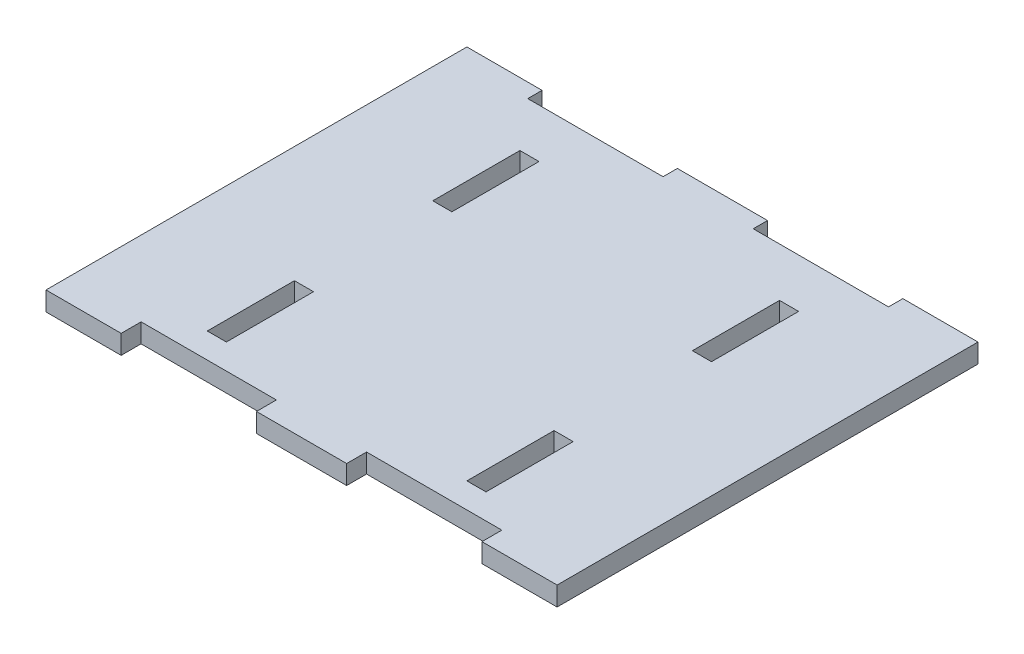
ISO-10303-21;
HEADER;
FILE_DESCRIPTION(('STEP AP214'),'2;1');
FILE_NAME('part.step','',(''),(''),'','','');
FILE_SCHEMA(('AUTOMOTIVE_DESIGN { 1 0 10303 214 1 1 1 1 }'));
ENDSEC;
DATA;
#1=APPLICATION_CONTEXT('core data for automotive mechanical design processes');
#2=APPLICATION_PROTOCOL_DEFINITION('international standard','automotive_design',2000,#1);
#3=PRODUCT_CONTEXT('',#1,'mechanical');
#4=PRODUCT('Part','Part','',(#3));
#5=PRODUCT_RELATED_PRODUCT_CATEGORY('part','',(#4));
#6=PRODUCT_DEFINITION_FORMATION('','',#4);
#7=PRODUCT_DEFINITION_CONTEXT('part definition',#1,'design');
#8=PRODUCT_DEFINITION('design','',#6,#7);
#9=PRODUCT_DEFINITION_SHAPE('','',#8);
#10=(LENGTH_UNIT() NAMED_UNIT(*) SI_UNIT(.MILLI.,.METRE.));
#11=(NAMED_UNIT(*) PLANE_ANGLE_UNIT() SI_UNIT($,.RADIAN.));
#12=(NAMED_UNIT(*) SI_UNIT($,.STERADIAN.) SOLID_ANGLE_UNIT());
#13=UNCERTAINTY_MEASURE_WITH_UNIT(LENGTH_MEASURE(1.E-05),#10,'distance_accuracy_value','');
#14=(GEOMETRIC_REPRESENTATION_CONTEXT(3) GLOBAL_UNCERTAINTY_ASSIGNED_CONTEXT((#13)) GLOBAL_UNIT_ASSIGNED_CONTEXT((#10,
#11,#12)) REPRESENTATION_CONTEXT('',''));
#15=CARTESIAN_POINT('',(0.,0.,0.));
#16=DIRECTION('',(0.,0.,1.));
#17=DIRECTION('',(1.,0.,0.));
#18=AXIS2_PLACEMENT_3D('',#15,#16,#17);
#19=CARTESIAN_POINT('',(0.,3.175,0.));
#20=DIRECTION('',(0.,0.,-1.));
#21=DIRECTION('',(-1.,0.,0.));
#22=AXIS2_PLACEMENT_3D('',#19,#20,#21);
#23=PLANE('',#22);
#24=DIRECTION('',(1.,0.,0.));
#25=VECTOR('',#24,1.);
#26=CARTESIAN_POINT('',(0.,3.175,0.));
#27=LINE('',#26,#25);
#28=CARTESIAN_POINT('',(35.,3.175,0.));
#29=VERTEX_POINT('',#28);
#30=CARTESIAN_POINT('',(50.,3.175,0.));
#31=VERTEX_POINT('',#30);
#32=EDGE_CURVE('E352',#29,#31,#27,.T.);
#33=ORIENTED_EDGE('',*,*,#32,.F.);
#34=DIRECTION('',(0.,-1.,0.));
#35=VECTOR('',#34,1.);
#36=CARTESIAN_POINT('',(35.,3.175,0.));
#37=LINE('',#36,#35);
#38=CARTESIAN_POINT('',(35.,0.,0.));
#39=VERTEX_POINT('',#38);
#40=EDGE_CURVE('E484',#29,#39,#37,.T.);
#41=ORIENTED_EDGE('',*,*,#40,.T.);
#42=DIRECTION('',(1.,0.,0.));
#43=VECTOR('',#42,1.);
#44=CARTESIAN_POINT('',(0.,0.,0.));
#45=LINE('',#44,#43);
#46=CARTESIAN_POINT('',(50.,0.,0.));
#47=VERTEX_POINT('',#46);
#48=EDGE_CURVE('E312',#39,#47,#45,.T.);
#49=ORIENTED_EDGE('',*,*,#48,.T.);
#50=DIRECTION('',(0.,-1.,0.));
#51=VECTOR('',#50,1.);
#52=CARTESIAN_POINT('',(50.,3.175,0.));
#53=LINE('',#52,#51);
#54=EDGE_CURVE('E512',#31,#47,#53,.T.);
#55=ORIENTED_EDGE('',*,*,#54,.F.);
#56=EDGE_LOOP('',(#33,#41,#49,#55));
#57=FACE_BOUND('',#56,.T.);
#58=ADVANCED_FACE('F32',(#57),#23,.F.);
#59=CARTESIAN_POINT('',(72.5,3.175,0.));
#60=VERTEX_POINT('',#59);
#61=CARTESIAN_POINT('',(85.,3.175,0.));
#62=VERTEX_POINT('',#61);
#63=EDGE_CURVE('E349',#60,#62,#27,.T.);
#64=ORIENTED_EDGE('',*,*,#63,.F.);
#65=DIRECTION('',(0.,-1.,0.));
#66=VECTOR('',#65,1.);
#67=CARTESIAN_POINT('',(72.5,3.175,0.));
#68=LINE('',#67,#66);
#69=CARTESIAN_POINT('',(72.5,0.,0.));
#70=VERTEX_POINT('',#69);
#71=EDGE_CURVE('E509',#60,#70,#68,.T.);
#72=ORIENTED_EDGE('',*,*,#71,.T.);
#73=CARTESIAN_POINT('',(85.,0.,0.));
#74=VERTEX_POINT('',#73);
#75=EDGE_CURVE('E306',#70,#74,#45,.T.);
#76=ORIENTED_EDGE('',*,*,#75,.T.);
#77=DIRECTION('',(0.,-1.,0.));
#78=VECTOR('',#77,1.);
#79=CARTESIAN_POINT('',(85.,3.175,0.));
#80=LINE('',#79,#78);
#81=EDGE_CURVE('E40',#62,#74,#80,.T.);
#82=ORIENTED_EDGE('',*,*,#81,.F.);
#83=EDGE_LOOP('',(#64,#72,#76,#82));
#84=FACE_BOUND('',#83,.T.);
#85=ADVANCED_FACE('F581',(#84),#23,.F.);
#86=CARTESIAN_POINT('',(0.,3.175,-70.));
#87=DIRECTION('',(0.,0.,1.));
#88=DIRECTION('',(1.,0.,0.));
#89=AXIS2_PLACEMENT_3D('',#86,#87,#88);
#90=PLANE('',#89);
#91=DIRECTION('',(-1.,0.,0.));
#92=VECTOR('',#91,1.);
#93=CARTESIAN_POINT('',(0.,0.,-70.));
#94=LINE('',#93,#92);
#95=CARTESIAN_POINT('',(50.,0.,-70.));
#96=VERTEX_POINT('',#95);
#97=CARTESIAN_POINT('',(35.,0.,-70.));
#98=VERTEX_POINT('',#97);
#99=EDGE_CURVE('E319',#96,#98,#94,.T.);
#100=ORIENTED_EDGE('',*,*,#99,.T.);
#101=DIRECTION('',(0.,-1.,0.));
#102=VECTOR('',#101,1.);
#103=CARTESIAN_POINT('',(35.,3.175,-70.));
#104=LINE('',#103,#102);
#105=CARTESIAN_POINT('',(35.,3.175,-70.));
#106=VERTEX_POINT('',#105);
#107=EDGE_CURVE('E293',#106,#98,#104,.T.);
#108=ORIENTED_EDGE('',*,*,#107,.F.);
#109=DIRECTION('',(-1.,0.,0.));
#110=VECTOR('',#109,1.);
#111=CARTESIAN_POINT('',(0.,3.175,-70.));
#112=LINE('',#111,#110);
#113=CARTESIAN_POINT('',(50.,3.175,-70.));
#114=VERTEX_POINT('',#113);
#115=EDGE_CURVE('E285',#114,#106,#112,.T.);
#116=ORIENTED_EDGE('',*,*,#115,.F.);
#117=DIRECTION('',(0.,-1.,0.));
#118=VECTOR('',#117,1.);
#119=CARTESIAN_POINT('',(50.,3.175,-70.));
#120=LINE('',#119,#118);
#121=EDGE_CURVE('E265',#114,#96,#120,.T.);
#122=ORIENTED_EDGE('',*,*,#121,.T.);
#123=EDGE_LOOP('',(#100,#108,#116,#122));
#124=FACE_BOUND('',#123,.T.);
#125=ADVANCED_FACE('F292',(#124),#90,.F.);
#126=CARTESIAN_POINT('',(12.5,3.175,-70.));
#127=VERTEX_POINT('',#126);
#128=CARTESIAN_POINT('',(0.,3.175,-70.));
#129=VERTEX_POINT('',#128);
#130=EDGE_CURVE('E295',#127,#129,#112,.T.);
#131=ORIENTED_EDGE('',*,*,#130,.F.);
#132=DIRECTION('',(0.,-1.,0.));
#133=VECTOR('',#132,1.);
#134=CARTESIAN_POINT('',(12.5,3.175,-70.));
#135=LINE('',#134,#133);
#136=CARTESIAN_POINT('',(12.5,0.,-70.));
#137=VERTEX_POINT('',#136);
#138=EDGE_CURVE('E540',#127,#137,#135,.T.);
#139=ORIENTED_EDGE('',*,*,#138,.T.);
#140=CARTESIAN_POINT('',(0.,0.,-70.));
#141=VERTEX_POINT('',#140);
#142=EDGE_CURVE('E314',#137,#141,#94,.T.);
#143=ORIENTED_EDGE('',*,*,#142,.T.);
#144=DIRECTION('',(0.,-1.,0.));
#145=VECTOR('',#144,1.);
#146=CARTESIAN_POINT('',(0.,3.175,-70.));
#147=LINE('',#146,#145);
#148=EDGE_CURVE('E298',#129,#141,#147,.T.);
#149=ORIENTED_EDGE('',*,*,#148,.F.);
#150=EDGE_LOOP('',(#131,#139,#143,#149));
#151=FACE_BOUND('',#150,.T.);
#152=ADVANCED_FACE('F595',(#151),#90,.F.);
#153=CARTESIAN_POINT('',(0.,3.175,0.));
#154=DIRECTION('',(1.,0.,0.));
#155=DIRECTION('',(0.,0.,-1.));
#156=AXIS2_PLACEMENT_3D('',#153,#154,#155);
#157=PLANE('',#156);
#158=DIRECTION('',(0.,0.,1.));
#159=VECTOR('',#158,1.);
#160=CARTESIAN_POINT('',(0.,0.,0.));
#161=LINE('',#160,#159);
#162=CARTESIAN_POINT('',(0.,0.,0.));
#163=VERTEX_POINT('',#162);
#164=EDGE_CURVE('E303',#141,#163,#161,.T.);
#165=ORIENTED_EDGE('',*,*,#164,.T.);
#166=DIRECTION('',(0.,-1.,0.));
#167=VECTOR('',#166,1.);
#168=CARTESIAN_POINT('',(0.,3.175,0.));
#169=LINE('',#168,#167);
#170=CARTESIAN_POINT('',(0.,3.175,0.));
#171=VERTEX_POINT('',#170);
#172=EDGE_CURVE('E11',#171,#163,#169,.T.);
#173=ORIENTED_EDGE('',*,*,#172,.F.);
#174=DIRECTION('',(0.,0.,1.));
#175=VECTOR('',#174,1.);
#176=CARTESIAN_POINT('',(0.,3.175,0.));
#177=LINE('',#176,#175);
#178=EDGE_CURVE('E318',#129,#171,#177,.T.);
#179=ORIENTED_EDGE('',*,*,#178,.F.);
#180=ORIENTED_EDGE('',*,*,#148,.T.);
#181=EDGE_LOOP('',(#165,#173,#179,#180));
#182=FACE_BOUND('',#181,.T.);
#183=ADVANCED_FACE('F34',(#182),#157,.F.);
#184=CARTESIAN_POINT('',(12.5,0.,0.));
#185=VERTEX_POINT('',#184);
#186=EDGE_CURVE('E308',#163,#185,#45,.T.);
#187=ORIENTED_EDGE('',*,*,#186,.T.);
#188=DIRECTION('',(0.,-1.,0.));
#189=VECTOR('',#188,1.);
#190=CARTESIAN_POINT('',(12.5,3.175,0.));
#191=LINE('',#190,#189);
#192=CARTESIAN_POINT('',(12.5,3.175,0.));
#193=VERTEX_POINT('',#192);
#194=EDGE_CURVE('E487',#193,#185,#191,.T.);
#195=ORIENTED_EDGE('',*,*,#194,.F.);
#196=EDGE_CURVE('E350',#171,#193,#27,.T.);
#197=ORIENTED_EDGE('',*,*,#196,.F.);
#198=ORIENTED_EDGE('',*,*,#172,.T.);
#199=EDGE_LOOP('',(#187,#195,#197,#198));
#200=FACE_BOUND('',#199,.T.);
#201=ADVANCED_FACE('F583',(#200),#23,.F.);
#202=CARTESIAN_POINT('',(85.,3.175,0.));
#203=DIRECTION('',(-1.,0.,0.));
#204=DIRECTION('',(0.,0.,1.));
#205=AXIS2_PLACEMENT_3D('',#202,#203,#204);
#206=PLANE('',#205);
#207=DIRECTION('',(0.,0.,-1.));
#208=VECTOR('',#207,1.);
#209=CARTESIAN_POINT('',(85.,0.,0.));
#210=LINE('',#209,#208);
#211=CARTESIAN_POINT('',(85.,0.,-70.));
#212=VERTEX_POINT('',#211);
#213=EDGE_CURVE('E311',#74,#212,#210,.T.);
#214=ORIENTED_EDGE('',*,*,#213,.T.);
#215=DIRECTION('',(0.,-1.,0.));
#216=VECTOR('',#215,1.);
#217=CARTESIAN_POINT('',(85.,3.175,-70.));
#218=LINE('',#217,#216);
#219=CARTESIAN_POINT('',(85.,3.175,-70.));
#220=VERTEX_POINT('',#219);
#221=EDGE_CURVE('E322',#220,#212,#218,.T.);
#222=ORIENTED_EDGE('',*,*,#221,.F.);
#223=DIRECTION('',(0.,0.,-1.));
#224=VECTOR('',#223,1.);
#225=CARTESIAN_POINT('',(85.,3.175,0.));
#226=LINE('',#225,#224);
#227=EDGE_CURVE('E299',#62,#220,#226,.T.);
#228=ORIENTED_EDGE('',*,*,#227,.F.);
#229=ORIENTED_EDGE('',*,*,#81,.T.);
#230=EDGE_LOOP('',(#214,#222,#228,#229));
#231=FACE_BOUND('',#230,.T.);
#232=ADVANCED_FACE('F329',(#231),#206,.F.);
#233=CARTESIAN_POINT('',(72.5,0.,-70.));
#234=VERTEX_POINT('',#233);
#235=EDGE_CURVE('E315',#212,#234,#94,.T.);
#236=ORIENTED_EDGE('',*,*,#235,.T.);
#237=DIRECTION('',(0.,-1.,0.));
#238=VECTOR('',#237,1.);
#239=CARTESIAN_POINT('',(72.5,3.175,-70.));
#240=LINE('',#239,#238);
#241=CARTESIAN_POINT('',(72.5,3.175,-70.));
#242=VERTEX_POINT('',#241);
#243=EDGE_CURVE('E276',#242,#234,#240,.T.);
#244=ORIENTED_EDGE('',*,*,#243,.F.);
#245=EDGE_CURVE('E294',#220,#242,#112,.T.);
#246=ORIENTED_EDGE('',*,*,#245,.F.);
#247=ORIENTED_EDGE('',*,*,#221,.T.);
#248=EDGE_LOOP('',(#236,#244,#246,#247));
#249=FACE_BOUND('',#248,.T.);
#250=ADVANCED_FACE('F346',(#249),#90,.F.);
#251=CARTESIAN_POINT('',(0.,3.175,0.));
#252=DIRECTION('',(0.,-1.,0.));
#253=DIRECTION('',(0.,0.,-1.));
#254=AXIS2_PLACEMENT_3D('',#251,#252,#253);
#255=PLANE('',#254);
#256=DIRECTION('',(1.,0.,0.));
#257=VECTOR('',#256,1.);
#258=CARTESIAN_POINT('',(35.,3.175,-3.31304347826087));
#259=LINE('',#258,#257);
#260=CARTESIAN_POINT('',(12.5,3.175,-3.31304347826088));
#261=VERTEX_POINT('',#260);
#262=CARTESIAN_POINT('',(35.,3.175,-3.31304347826087));
#263=VERTEX_POINT('',#262);
#264=EDGE_CURVE('E488',#261,#263,#259,.T.);
#265=ORIENTED_EDGE('',*,*,#264,.T.);
#266=DIRECTION('',(0.,0.,1.));
#267=VECTOR('',#266,1.);
#268=CARTESIAN_POINT('',(35.,3.175,-3.31304347826087));
#269=LINE('',#268,#267);
#270=EDGE_CURVE('E498',#263,#29,#269,.T.);
#271=ORIENTED_EDGE('',*,*,#270,.T.);
#272=ORIENTED_EDGE('',*,*,#32,.T.);
#273=DIRECTION('',(0.,0.,-1.));
#274=VECTOR('',#273,1.);
#275=CARTESIAN_POINT('',(50.,3.175,-3.31304347826087));
#276=LINE('',#275,#274);
#277=CARTESIAN_POINT('',(50.,3.175,-3.31304347826087));
#278=VERTEX_POINT('',#277);
#279=EDGE_CURVE('E530',#31,#278,#276,.T.);
#280=ORIENTED_EDGE('',*,*,#279,.T.);
#281=DIRECTION('',(1.,0.,0.));
#282=VECTOR('',#281,1.);
#283=CARTESIAN_POINT('',(72.5,3.175,-3.31304347826087));
#284=LINE('',#283,#282);
#285=CARTESIAN_POINT('',(72.5,3.175,-3.31304347826087));
#286=VERTEX_POINT('',#285);
#287=EDGE_CURVE('E513',#278,#286,#284,.T.);
#288=ORIENTED_EDGE('',*,*,#287,.T.);
#289=DIRECTION('',(0.,0.,1.));
#290=VECTOR('',#289,1.);
#291=CARTESIAN_POINT('',(72.5,3.175,-3.31304347826087));
#292=LINE('',#291,#290);
#293=EDGE_CURVE('E523',#286,#60,#292,.T.);
#294=ORIENTED_EDGE('',*,*,#293,.T.);
#295=ORIENTED_EDGE('',*,*,#63,.T.);
#296=ORIENTED_EDGE('',*,*,#227,.T.);
#297=ORIENTED_EDGE('',*,*,#245,.T.);
#298=DIRECTION('',(0.,0.,1.));
#299=VECTOR('',#298,1.);
#300=CARTESIAN_POINT('',(72.5,3.175,-70.));
#301=LINE('',#300,#299);
#302=CARTESIAN_POINT('',(72.5,3.175,-67.61875));
#303=VERTEX_POINT('',#302);
#304=EDGE_CURVE('E288',#242,#303,#301,.T.);
#305=ORIENTED_EDGE('',*,*,#304,.T.);
#306=DIRECTION('',(-1.,0.,0.));
#307=VECTOR('',#306,1.);
#308=CARTESIAN_POINT('',(50.,3.175,-67.61875));
#309=LINE('',#308,#307);
#310=CARTESIAN_POINT('',(50.,3.175,-67.61875));
#311=VERTEX_POINT('',#310);
#312=EDGE_CURVE('E277',#303,#311,#309,.T.);
#313=ORIENTED_EDGE('',*,*,#312,.T.);
#314=DIRECTION('',(0.,0.,-1.));
#315=VECTOR('',#314,1.);
#316=CARTESIAN_POINT('',(50.,3.175,-70.));
#317=LINE('',#316,#315);
#318=EDGE_CURVE('E268',#311,#114,#317,.T.);
#319=ORIENTED_EDGE('',*,*,#318,.T.);
#320=ORIENTED_EDGE('',*,*,#115,.T.);
#321=DIRECTION('',(0.,0.,1.));
#322=VECTOR('',#321,1.);
#323=CARTESIAN_POINT('',(35.,3.175,-70.));
#324=LINE('',#323,#322);
#325=CARTESIAN_POINT('',(35.,3.175,-67.61875));
#326=VERTEX_POINT('',#325);
#327=EDGE_CURVE('E546',#106,#326,#324,.T.);
#328=ORIENTED_EDGE('',*,*,#327,.T.);
#329=DIRECTION('',(-1.,0.,0.));
#330=VECTOR('',#329,1.);
#331=CARTESIAN_POINT('',(35.,3.175,-67.61875));
#332=LINE('',#331,#330);
#333=CARTESIAN_POINT('',(12.5,3.175,-67.61875));
#334=VERTEX_POINT('',#333);
#335=EDGE_CURVE('E553',#326,#334,#332,.T.);
#336=ORIENTED_EDGE('',*,*,#335,.T.);
#337=DIRECTION('',(0.,0.,-1.));
#338=VECTOR('',#337,1.);
#339=CARTESIAN_POINT('',(12.5,3.175,-70.));
#340=LINE('',#339,#338);
#341=EDGE_CURVE('E538',#334,#127,#340,.T.);
#342=ORIENTED_EDGE('',*,*,#341,.T.);
#343=ORIENTED_EDGE('',*,*,#130,.T.);
#344=ORIENTED_EDGE('',*,*,#178,.T.);
#345=ORIENTED_EDGE('',*,*,#196,.T.);
#346=DIRECTION('',(0.,0.,-1.));
#347=VECTOR('',#346,1.);
#348=CARTESIAN_POINT('',(12.5,3.175,-3.31304347826088));
#349=LINE('',#348,#347);
#350=EDGE_CURVE('E505',#193,#261,#349,.T.);
#351=ORIENTED_EDGE('',*,*,#350,.T.);
#352=EDGE_LOOP('',(#265,#271,#272,#280,#288,#294,#295,#296,#297,#305,#313,#319,#320,#328,#336,
#342,#343,#344,#345,#351));
#353=FACE_BOUND('',#352,.T.);
#354=DIRECTION('',(-1.,0.,0.));
#355=VECTOR('',#354,1.);
#356=CARTESIAN_POINT('',(62.5000000000004,3.175,-45.));
#357=LINE('',#356,#355);
#358=CARTESIAN_POINT('',(65.6750000000003,3.175,-45.));
#359=VERTEX_POINT('',#358);
#360=CARTESIAN_POINT('',(62.5000000000004,3.175,-45.));
#361=VERTEX_POINT('',#360);
#362=EDGE_CURVE('E396',#359,#361,#357,.T.);
#363=ORIENTED_EDGE('',*,*,#362,.T.);
#364=DIRECTION('',(0.,0.,-1.));
#365=VECTOR('',#364,1.);
#366=CARTESIAN_POINT('',(62.5000000000004,3.175,-45.));
#367=LINE('',#366,#365);
#368=CARTESIAN_POINT('',(62.5000000000004,3.175,-59.492));
#369=VERTEX_POINT('',#368);
#370=EDGE_CURVE('E406',#361,#369,#367,.T.);
#371=ORIENTED_EDGE('',*,*,#370,.T.);
#372=DIRECTION('',(1.,0.,0.));
#373=VECTOR('',#372,1.);
#374=CARTESIAN_POINT('',(62.5000000000004,3.175,-59.492));
#375=LINE('',#374,#373);
#376=CARTESIAN_POINT('',(65.6750000000003,3.175,-59.492));
#377=VERTEX_POINT('',#376);
#378=EDGE_CURVE('E419',#369,#377,#375,.T.);
#379=ORIENTED_EDGE('',*,*,#378,.T.);
#380=DIRECTION('',(0.,0.,1.));
#381=VECTOR('',#380,1.);
#382=CARTESIAN_POINT('',(65.6750000000003,3.175,-45.));
#383=LINE('',#382,#381);
#384=EDGE_CURVE('E47',#377,#359,#383,.T.);
#385=ORIENTED_EDGE('',*,*,#384,.T.);
#386=EDGE_LOOP('',(#363,#371,#379,#385));
#387=FACE_BOUND('',#386,.T.);
#388=DIRECTION('',(-1.,0.,0.));
#389=VECTOR('',#388,1.);
#390=CARTESIAN_POINT('',(62.5000000000006,3.175,-7.5));
#391=LINE('',#390,#389);
#392=CARTESIAN_POINT('',(65.6750000000005,3.175,-7.5));
#393=VERTEX_POINT('',#392);
#394=CARTESIAN_POINT('',(62.5000000000006,3.175,-7.5));
#395=VERTEX_POINT('',#394);
#396=EDGE_CURVE('E428',#393,#395,#391,.T.);
#397=ORIENTED_EDGE('',*,*,#396,.T.);
#398=DIRECTION('',(0.,0.,-1.));
#399=VECTOR('',#398,1.);
#400=CARTESIAN_POINT('',(62.5000000000006,3.175,-7.5));
#401=LINE('',#400,#399);
#402=CARTESIAN_POINT('',(62.5000000000006,3.175,-21.992));
#403=VERTEX_POINT('',#402);
#404=EDGE_CURVE('E438',#395,#403,#401,.T.);
#405=ORIENTED_EDGE('',*,*,#404,.T.);
#406=DIRECTION('',(1.,0.,0.));
#407=VECTOR('',#406,1.);
#408=CARTESIAN_POINT('',(62.5000000000006,3.175,-21.992));
#409=LINE('',#408,#407);
#410=CARTESIAN_POINT('',(65.6750000000005,3.175,-21.992));
#411=VERTEX_POINT('',#410);
#412=EDGE_CURVE('E449',#403,#411,#409,.T.);
#413=ORIENTED_EDGE('',*,*,#412,.T.);
#414=DIRECTION('',(0.,0.,1.));
#415=VECTOR('',#414,1.);
#416=CARTESIAN_POINT('',(65.6750000000005,3.175,-7.5));
#417=LINE('',#416,#415);
#418=EDGE_CURVE('E55',#411,#393,#417,.T.);
#419=ORIENTED_EDGE('',*,*,#418,.T.);
#420=EDGE_LOOP('',(#397,#405,#413,#419));
#421=FACE_BOUND('',#420,.T.);
#422=DIRECTION('',(-1.,0.,0.));
#423=VECTOR('',#422,1.);
#424=CARTESIAN_POINT('',(19.3250000000004,3.175,-45.));
#425=LINE('',#424,#423);
#426=CARTESIAN_POINT('',(22.5000000000003,3.175,-45.));
#427=VERTEX_POINT('',#426);
#428=CARTESIAN_POINT('',(19.3250000000004,3.175,-45.));
#429=VERTEX_POINT('',#428);
#430=EDGE_CURVE('E458',#427,#429,#425,.T.);
#431=ORIENTED_EDGE('',*,*,#430,.T.);
#432=DIRECTION('',(0.,0.,-1.));
#433=VECTOR('',#432,1.);
#434=CARTESIAN_POINT('',(19.3250000000004,3.175,-45.));
#435=LINE('',#434,#433);
#436=CARTESIAN_POINT('',(19.3250000000004,3.175,-59.492));
#437=VERTEX_POINT('',#436);
#438=EDGE_CURVE('E466',#429,#437,#435,.T.);
#439=ORIENTED_EDGE('',*,*,#438,.T.);
#440=DIRECTION('',(1.,0.,0.));
#441=VECTOR('',#440,1.);
#442=CARTESIAN_POINT('',(19.3250000000004,3.175,-59.492));
#443=LINE('',#442,#441);
#444=CARTESIAN_POINT('',(22.5000000000003,3.175,-59.492));
#445=VERTEX_POINT('',#444);
#446=EDGE_CURVE('E479',#437,#445,#443,.T.);
#447=ORIENTED_EDGE('',*,*,#446,.T.);
#448=DIRECTION('',(0.,0.,1.));
#449=VECTOR('',#448,1.);
#450=CARTESIAN_POINT('',(22.5000000000003,3.175,-45.));
#451=LINE('',#450,#449);
#452=EDGE_CURVE('E476',#445,#427,#451,.T.);
#453=ORIENTED_EDGE('',*,*,#452,.T.);
#454=EDGE_LOOP('',(#431,#439,#447,#453));
#455=FACE_BOUND('',#454,.T.);
#456=DIRECTION('',(-1.,0.,0.));
#457=VECTOR('',#456,1.);
#458=CARTESIAN_POINT('',(19.3250000000006,3.175,-7.5));
#459=LINE('',#458,#457);
#460=CARTESIAN_POINT('',(22.5000000000005,3.175,-7.5));
#461=VERTEX_POINT('',#460);
#462=CARTESIAN_POINT('',(19.3250000000006,3.175,-7.5));
#463=VERTEX_POINT('',#462);
#464=EDGE_CURVE('E364',#461,#463,#459,.T.);
#465=ORIENTED_EDGE('',*,*,#464,.T.);
#466=DIRECTION('',(0.,0.,-1.));
#467=VECTOR('',#466,1.);
#468=CARTESIAN_POINT('',(19.3250000000006,3.175,-7.5));
#469=LINE('',#468,#467);
#470=CARTESIAN_POINT('',(19.3250000000006,3.175,-21.992));
#471=VERTEX_POINT('',#470);
#472=EDGE_CURVE('E372',#463,#471,#469,.T.);
#473=ORIENTED_EDGE('',*,*,#472,.T.);
#474=DIRECTION('',(1.,0.,0.));
#475=VECTOR('',#474,1.);
#476=CARTESIAN_POINT('',(19.3250000000006,3.175,-21.992));
#477=LINE('',#476,#475);
#478=CARTESIAN_POINT('',(22.5000000000005,3.175,-21.992));
#479=VERTEX_POINT('',#478);
#480=EDGE_CURVE('E387',#471,#479,#477,.T.);
#481=ORIENTED_EDGE('',*,*,#480,.T.);
#482=DIRECTION('',(0.,0.,1.));
#483=VECTOR('',#482,1.);
#484=CARTESIAN_POINT('',(22.5000000000005,3.175,-7.5));
#485=LINE('',#484,#483);
#486=EDGE_CURVE('E384',#479,#461,#485,.T.);
#487=ORIENTED_EDGE('',*,*,#486,.T.);
#488=EDGE_LOOP('',(#465,#473,#481,#487));
#489=FACE_BOUND('',#488,.T.);
#490=ADVANCED_FACE('F282',(#353,#387,#421,#455,#489),#255,.F.);
#491=CARTESIAN_POINT('',(0.,0.,0.));
#492=DIRECTION('',(0.,-1.,0.));
#493=DIRECTION('',(0.,0.,-1.));
#494=AXIS2_PLACEMENT_3D('',#491,#492,#493);
#495=PLANE('',#494);
#496=DIRECTION('',(0.,0.,1.));
#497=VECTOR('',#496,1.);
#498=CARTESIAN_POINT('',(35.,0.,-3.31304347826087));
#499=LINE('',#498,#497);
#500=CARTESIAN_POINT('',(35.,0.,-3.31304347826087));
#501=VERTEX_POINT('',#500);
#502=EDGE_CURVE('E502',#501,#39,#499,.T.);
#503=ORIENTED_EDGE('',*,*,#502,.F.);
#504=DIRECTION('',(1.,0.,0.));
#505=VECTOR('',#504,1.);
#506=CARTESIAN_POINT('',(35.,0.,-3.31304347826087));
#507=LINE('',#506,#505);
#508=CARTESIAN_POINT('',(12.5,0.,-3.31304347826088));
#509=VERTEX_POINT('',#508);
#510=EDGE_CURVE('E495',#509,#501,#507,.T.);
#511=ORIENTED_EDGE('',*,*,#510,.F.);
#512=DIRECTION('',(0.,0.,-1.));
#513=VECTOR('',#512,1.);
#514=CARTESIAN_POINT('',(12.5,0.,-3.31304347826088));
#515=LINE('',#514,#513);
#516=EDGE_CURVE('E499',#185,#509,#515,.T.);
#517=ORIENTED_EDGE('',*,*,#516,.F.);
#518=ORIENTED_EDGE('',*,*,#186,.F.);
#519=ORIENTED_EDGE('',*,*,#164,.F.);
#520=ORIENTED_EDGE('',*,*,#142,.F.);
#521=DIRECTION('',(0.,0.,-1.));
#522=VECTOR('',#521,1.);
#523=CARTESIAN_POINT('',(12.5,0.,-70.));
#524=LINE('',#523,#522);
#525=CARTESIAN_POINT('',(12.5,0.,-67.61875));
#526=VERTEX_POINT('',#525);
#527=EDGE_CURVE('E544',#526,#137,#524,.T.);
#528=ORIENTED_EDGE('',*,*,#527,.F.);
#529=DIRECTION('',(-1.,0.,0.));
#530=VECTOR('',#529,1.);
#531=CARTESIAN_POINT('',(35.,0.,-67.61875));
#532=LINE('',#531,#530);
#533=CARTESIAN_POINT('',(35.,0.,-67.61875));
#534=VERTEX_POINT('',#533);
#535=EDGE_CURVE('E547',#534,#526,#532,.T.);
#536=ORIENTED_EDGE('',*,*,#535,.F.);
#537=DIRECTION('',(0.,0.,1.));
#538=VECTOR('',#537,1.);
#539=CARTESIAN_POINT('',(35.,0.,-70.));
#540=LINE('',#539,#538);
#541=EDGE_CURVE('E519',#98,#534,#540,.T.);
#542=ORIENTED_EDGE('',*,*,#541,.F.);
#543=ORIENTED_EDGE('',*,*,#99,.F.);
#544=DIRECTION('',(0.,0.,-1.));
#545=VECTOR('',#544,1.);
#546=CARTESIAN_POINT('',(50.,0.,-70.));
#547=LINE('',#546,#545);
#548=CARTESIAN_POINT('',(50.,0.,-67.61875));
#549=VERTEX_POINT('',#548);
#550=EDGE_CURVE('E271',#549,#96,#547,.T.);
#551=ORIENTED_EDGE('',*,*,#550,.F.);
#552=DIRECTION('',(-1.,0.,0.));
#553=VECTOR('',#552,1.);
#554=CARTESIAN_POINT('',(50.,0.,-67.61875));
#555=LINE('',#554,#553);
#556=CARTESIAN_POINT('',(72.5,0.,-67.61875));
#557=VERTEX_POINT('',#556);
#558=EDGE_CURVE('E289',#557,#549,#555,.T.);
#559=ORIENTED_EDGE('',*,*,#558,.F.);
#560=DIRECTION('',(0.,0.,1.));
#561=VECTOR('',#560,1.);
#562=CARTESIAN_POINT('',(72.5,0.,-70.));
#563=LINE('',#562,#561);
#564=EDGE_CURVE('E343',#234,#557,#563,.T.);
#565=ORIENTED_EDGE('',*,*,#564,.F.);
#566=ORIENTED_EDGE('',*,*,#235,.F.);
#567=ORIENTED_EDGE('',*,*,#213,.F.);
#568=ORIENTED_EDGE('',*,*,#75,.F.);
#569=DIRECTION('',(0.,0.,1.));
#570=VECTOR('',#569,1.);
#571=CARTESIAN_POINT('',(72.5,0.,-3.31304347826087));
#572=LINE('',#571,#570);
#573=CARTESIAN_POINT('',(72.5,0.,-3.31304347826087));
#574=VERTEX_POINT('',#573);
#575=EDGE_CURVE('E494',#574,#70,#572,.T.);
#576=ORIENTED_EDGE('',*,*,#575,.F.);
#577=DIRECTION('',(1.,0.,0.));
#578=VECTOR('',#577,1.);
#579=CARTESIAN_POINT('',(72.5,0.,-3.31304347826087));
#580=LINE('',#579,#578);
#581=CARTESIAN_POINT('',(50.,0.,-3.31304347826087));
#582=VERTEX_POINT('',#581);
#583=EDGE_CURVE('E520',#582,#574,#580,.T.);
#584=ORIENTED_EDGE('',*,*,#583,.F.);
#585=DIRECTION('',(0.,0.,-1.));
#586=VECTOR('',#585,1.);
#587=CARTESIAN_POINT('',(50.,0.,-3.31304347826087));
#588=LINE('',#587,#586);
#589=EDGE_CURVE('E524',#47,#582,#588,.T.);
#590=ORIENTED_EDGE('',*,*,#589,.F.);
#591=ORIENTED_EDGE('',*,*,#48,.F.);
#592=EDGE_LOOP('',(#503,#511,#517,#518,#519,#520,#528,#536,#542,#543,#551,#559,#565,#566,#567,
#568,#576,#584,#590,#591));
#593=FACE_BOUND('',#592,.T.);
#594=DIRECTION('',(0.,0.,-1.));
#595=VECTOR('',#594,1.);
#596=CARTESIAN_POINT('',(62.5000000000004,0.,-45.));
#597=LINE('',#596,#595);
#598=CARTESIAN_POINT('',(62.5000000000004,0.,-45.));
#599=VERTEX_POINT('',#598);
#600=CARTESIAN_POINT('',(62.5000000000004,0.,-59.492));
#601=VERTEX_POINT('',#600);
#602=EDGE_CURVE('E413',#599,#601,#597,.T.);
#603=ORIENTED_EDGE('',*,*,#602,.F.);
#604=DIRECTION('',(-1.,0.,0.));
#605=VECTOR('',#604,1.);
#606=CARTESIAN_POINT('',(62.5000000000004,0.,-45.));
#607=LINE('',#606,#605);
#608=CARTESIAN_POINT('',(65.6750000000003,0.,-45.));
#609=VERTEX_POINT('',#608);
#610=EDGE_CURVE('E403',#609,#599,#607,.T.);
#611=ORIENTED_EDGE('',*,*,#610,.F.);
#612=DIRECTION('',(0.,0.,1.));
#613=VECTOR('',#612,1.);
#614=CARTESIAN_POINT('',(65.6750000000003,0.,-45.));
#615=LINE('',#614,#613);
#616=CARTESIAN_POINT('',(65.6750000000003,0.,-59.492));
#617=VERTEX_POINT('',#616);
#618=EDGE_CURVE('E407',#617,#609,#615,.T.);
#619=ORIENTED_EDGE('',*,*,#618,.F.);
#620=DIRECTION('',(1.,0.,0.));
#621=VECTOR('',#620,1.);
#622=CARTESIAN_POINT('',(62.5000000000004,0.,-59.492));
#623=LINE('',#622,#621);
#624=EDGE_CURVE('E410',#601,#617,#623,.T.);
#625=ORIENTED_EDGE('',*,*,#624,.F.);
#626=EDGE_LOOP('',(#603,#611,#619,#625));
#627=FACE_BOUND('',#626,.T.);
#628=DIRECTION('',(0.,0.,-1.));
#629=VECTOR('',#628,1.);
#630=CARTESIAN_POINT('',(62.5000000000006,0.,-7.5));
#631=LINE('',#630,#629);
#632=CARTESIAN_POINT('',(62.5000000000006,0.,-7.5));
#633=VERTEX_POINT('',#632);
#634=CARTESIAN_POINT('',(62.5000000000006,0.,-21.992));
#635=VERTEX_POINT('',#634);
#636=EDGE_CURVE('E402',#633,#635,#631,.T.);
#637=ORIENTED_EDGE('',*,*,#636,.F.);
#638=DIRECTION('',(-1.,0.,0.));
#639=VECTOR('',#638,1.);
#640=CARTESIAN_POINT('',(62.5000000000006,0.,-7.5));
#641=LINE('',#640,#639);
#642=CARTESIAN_POINT('',(65.6750000000005,0.,-7.5));
#643=VERTEX_POINT('',#642);
#644=EDGE_CURVE('E435',#643,#633,#641,.T.);
#645=ORIENTED_EDGE('',*,*,#644,.F.);
#646=DIRECTION('',(0.,0.,1.));
#647=VECTOR('',#646,1.);
#648=CARTESIAN_POINT('',(65.6750000000005,0.,-7.5));
#649=LINE('',#648,#647);
#650=CARTESIAN_POINT('',(65.6750000000005,0.,-21.992));
#651=VERTEX_POINT('',#650);
#652=EDGE_CURVE('E439',#651,#643,#649,.T.);
#653=ORIENTED_EDGE('',*,*,#652,.F.);
#654=DIRECTION('',(1.,0.,0.));
#655=VECTOR('',#654,1.);
#656=CARTESIAN_POINT('',(62.5000000000006,0.,-21.992));
#657=LINE('',#656,#655);
#658=EDGE_CURVE('E442',#635,#651,#657,.T.);
#659=ORIENTED_EDGE('',*,*,#658,.F.);
#660=EDGE_LOOP('',(#637,#645,#653,#659));
#661=FACE_BOUND('',#660,.T.);
#662=DIRECTION('',(0.,0.,-1.));
#663=VECTOR('',#662,1.);
#664=CARTESIAN_POINT('',(19.3250000000004,0.,-45.));
#665=LINE('',#664,#663);
#666=CARTESIAN_POINT('',(19.3250000000004,0.,-45.));
#667=VERTEX_POINT('',#666);
#668=CARTESIAN_POINT('',(19.3250000000004,0.,-59.492));
#669=VERTEX_POINT('',#668);
#670=EDGE_CURVE('E434',#667,#669,#665,.T.);
#671=ORIENTED_EDGE('',*,*,#670,.F.);
#672=DIRECTION('',(-1.,0.,0.));
#673=VECTOR('',#672,1.);
#674=CARTESIAN_POINT('',(19.3250000000004,0.,-45.));
#675=LINE('',#674,#673);
#676=CARTESIAN_POINT('',(22.5000000000003,0.,-45.));
#677=VERTEX_POINT('',#676);
#678=EDGE_CURVE('E463',#677,#667,#675,.T.);
#679=ORIENTED_EDGE('',*,*,#678,.F.);
#680=DIRECTION('',(0.,0.,1.));
#681=VECTOR('',#680,1.);
#682=CARTESIAN_POINT('',(22.5000000000003,0.,-45.));
#683=LINE('',#682,#681);
#684=CARTESIAN_POINT('',(22.5000000000003,0.,-59.492));
#685=VERTEX_POINT('',#684);
#686=EDGE_CURVE('E467',#685,#677,#683,.T.);
#687=ORIENTED_EDGE('',*,*,#686,.F.);
#688=DIRECTION('',(1.,0.,0.));
#689=VECTOR('',#688,1.);
#690=CARTESIAN_POINT('',(19.3250000000004,0.,-59.492));
#691=LINE('',#690,#689);
#692=EDGE_CURVE('E470',#669,#685,#691,.T.);
#693=ORIENTED_EDGE('',*,*,#692,.F.);
#694=EDGE_LOOP('',(#671,#679,#687,#693));
#695=FACE_BOUND('',#694,.T.);
#696=DIRECTION('',(0.,0.,-1.));
#697=VECTOR('',#696,1.);
#698=CARTESIAN_POINT('',(19.3250000000006,0.,-7.5));
#699=LINE('',#698,#697);
#700=CARTESIAN_POINT('',(19.3250000000006,0.,-7.5));
#701=VERTEX_POINT('',#700);
#702=CARTESIAN_POINT('',(19.3250000000006,0.,-21.992));
#703=VERTEX_POINT('',#702);
#704=EDGE_CURVE('E379',#701,#703,#699,.T.);
#705=ORIENTED_EDGE('',*,*,#704,.F.);
#706=DIRECTION('',(-1.,0.,0.));
#707=VECTOR('',#706,1.);
#708=CARTESIAN_POINT('',(19.3250000000006,0.,-7.5));
#709=LINE('',#708,#707);
#710=CARTESIAN_POINT('',(22.5000000000005,0.,-7.5));
#711=VERTEX_POINT('',#710);
#712=EDGE_CURVE('E369',#711,#701,#709,.T.);
#713=ORIENTED_EDGE('',*,*,#712,.F.);
#714=DIRECTION('',(0.,0.,1.));
#715=VECTOR('',#714,1.);
#716=CARTESIAN_POINT('',(22.5000000000005,0.,-7.5));
#717=LINE('',#716,#715);
#718=CARTESIAN_POINT('',(22.5000000000005,0.,-21.992));
#719=VERTEX_POINT('',#718);
#720=EDGE_CURVE('E373',#719,#711,#717,.T.);
#721=ORIENTED_EDGE('',*,*,#720,.F.);
#722=DIRECTION('',(1.,0.,0.));
#723=VECTOR('',#722,1.);
#724=CARTESIAN_POINT('',(19.3250000000006,0.,-21.992));
#725=LINE('',#724,#723);
#726=EDGE_CURVE('E376',#703,#719,#725,.T.);
#727=ORIENTED_EDGE('',*,*,#726,.F.);
#728=EDGE_LOOP('',(#705,#713,#721,#727));
#729=FACE_BOUND('',#728,.T.);
#730=ADVANCED_FACE('F337',(#593,#627,#661,#695,#729),#495,.T.);
#731=CARTESIAN_POINT('',(19.3250000000006,3.175,-7.5));
#732=DIRECTION('',(-1.,0.,0.));
#733=DIRECTION('',(0.,0.,1.));
#734=AXIS2_PLACEMENT_3D('',#731,#732,#733);
#735=PLANE('',#734);
#736=ORIENTED_EDGE('',*,*,#704,.T.);
#737=DIRECTION('',(0.,-1.,0.));
#738=VECTOR('',#737,1.);
#739=CARTESIAN_POINT('',(19.3250000000006,3.175,-21.992));
#740=LINE('',#739,#738);
#741=EDGE_CURVE('E360',#471,#703,#740,.T.);
#742=ORIENTED_EDGE('',*,*,#741,.F.);
#743=ORIENTED_EDGE('',*,*,#472,.F.);
#744=DIRECTION('',(0.,-1.,0.));
#745=VECTOR('',#744,1.);
#746=CARTESIAN_POINT('',(19.3250000000006,3.175,-7.5));
#747=LINE('',#746,#745);
#748=EDGE_CURVE('E307',#463,#701,#747,.T.);
#749=ORIENTED_EDGE('',*,*,#748,.T.);
#750=EDGE_LOOP('',(#736,#742,#743,#749));
#751=FACE_BOUND('',#750,.T.);
#752=ADVANCED_FACE('F690',(#751),#735,.F.);
#753=CARTESIAN_POINT('',(19.3250000000006,3.175,-7.5));
#754=DIRECTION('',(0.,0.,1.));
#755=DIRECTION('',(1.,0.,0.));
#756=AXIS2_PLACEMENT_3D('',#753,#754,#755);
#757=PLANE('',#756);
#758=ORIENTED_EDGE('',*,*,#712,.T.);
#759=ORIENTED_EDGE('',*,*,#748,.F.);
#760=ORIENTED_EDGE('',*,*,#464,.F.);
#761=DIRECTION('',(0.,-1.,0.));
#762=VECTOR('',#761,1.);
#763=CARTESIAN_POINT('',(22.5000000000005,3.175,-7.5));
#764=LINE('',#763,#762);
#765=EDGE_CURVE('E366',#461,#711,#764,.T.);
#766=ORIENTED_EDGE('',*,*,#765,.T.);
#767=EDGE_LOOP('',(#758,#759,#760,#766));
#768=FACE_BOUND('',#767,.T.);
#769=ADVANCED_FACE('F686',(#768),#757,.F.);
#770=CARTESIAN_POINT('',(22.5000000000005,3.175,-7.5));
#771=DIRECTION('',(1.,0.,0.));
#772=DIRECTION('',(0.,0.,-1.));
#773=AXIS2_PLACEMENT_3D('',#770,#771,#772);
#774=PLANE('',#773);
#775=ORIENTED_EDGE('',*,*,#720,.T.);
#776=ORIENTED_EDGE('',*,*,#765,.F.);
#777=ORIENTED_EDGE('',*,*,#486,.F.);
#778=DIRECTION('',(0.,-1.,0.));
#779=VECTOR('',#778,1.);
#780=CARTESIAN_POINT('',(22.5000000000005,3.175,-21.992));
#781=LINE('',#780,#779);
#782=EDGE_CURVE('E363',#479,#719,#781,.T.);
#783=ORIENTED_EDGE('',*,*,#782,.T.);
#784=EDGE_LOOP('',(#775,#776,#777,#783));
#785=FACE_BOUND('',#784,.T.);
#786=ADVANCED_FACE('F689',(#785),#774,.F.);
#787=CARTESIAN_POINT('',(19.3250000000006,3.175,-21.992));
#788=DIRECTION('',(0.,0.,-1.));
#789=DIRECTION('',(-1.,0.,0.));
#790=AXIS2_PLACEMENT_3D('',#787,#788,#789);
#791=PLANE('',#790);
#792=ORIENTED_EDGE('',*,*,#726,.T.);
#793=ORIENTED_EDGE('',*,*,#782,.F.);
#794=ORIENTED_EDGE('',*,*,#480,.F.);
#795=ORIENTED_EDGE('',*,*,#741,.T.);
#796=EDGE_LOOP('',(#792,#793,#794,#795));
#797=FACE_BOUND('',#796,.T.);
#798=ADVANCED_FACE('F656',(#797),#791,.F.);
#799=CARTESIAN_POINT('',(19.3250000000004,3.175,-45.));
#800=DIRECTION('',(-1.,0.,0.));
#801=DIRECTION('',(0.,0.,1.));
#802=AXIS2_PLACEMENT_3D('',#799,#800,#801);
#803=PLANE('',#802);
#804=ORIENTED_EDGE('',*,*,#670,.T.);
#805=DIRECTION('',(0.,-1.,0.));
#806=VECTOR('',#805,1.);
#807=CARTESIAN_POINT('',(19.3250000000004,3.175,-59.492));
#808=LINE('',#807,#806);
#809=EDGE_CURVE('E454',#437,#669,#808,.T.);
#810=ORIENTED_EDGE('',*,*,#809,.F.);
#811=ORIENTED_EDGE('',*,*,#438,.F.);
#812=DIRECTION('',(0.,-1.,0.));
#813=VECTOR('',#812,1.);
#814=CARTESIAN_POINT('',(19.3250000000004,3.175,-45.));
#815=LINE('',#814,#813);
#816=EDGE_CURVE('E381',#429,#667,#815,.T.);
#817=ORIENTED_EDGE('',*,*,#816,.T.);
#818=EDGE_LOOP('',(#804,#810,#811,#817));
#819=FACE_BOUND('',#818,.T.);
#820=ADVANCED_FACE('F644',(#819),#803,.F.);
#821=CARTESIAN_POINT('',(19.3250000000004,3.175,-45.));
#822=DIRECTION('',(0.,0.,1.));
#823=DIRECTION('',(1.,0.,0.));
#824=AXIS2_PLACEMENT_3D('',#821,#822,#823);
#825=PLANE('',#824);
#826=ORIENTED_EDGE('',*,*,#678,.T.);
#827=ORIENTED_EDGE('',*,*,#816,.F.);
#828=ORIENTED_EDGE('',*,*,#430,.F.);
#829=DIRECTION('',(0.,-1.,0.));
#830=VECTOR('',#829,1.);
#831=CARTESIAN_POINT('',(22.5000000000003,3.175,-45.));
#832=LINE('',#831,#830);
#833=EDGE_CURVE('E460',#427,#677,#832,.T.);
#834=ORIENTED_EDGE('',*,*,#833,.T.);
#835=EDGE_LOOP('',(#826,#827,#828,#834));
#836=FACE_BOUND('',#835,.T.);
#837=ADVANCED_FACE('F640',(#836),#825,.F.);
#838=CARTESIAN_POINT('',(22.5000000000003,3.175,-45.));
#839=DIRECTION('',(1.,0.,0.));
#840=DIRECTION('',(0.,0.,-1.));
#841=AXIS2_PLACEMENT_3D('',#838,#839,#840);
#842=PLANE('',#841);
#843=ORIENTED_EDGE('',*,*,#686,.T.);
#844=ORIENTED_EDGE('',*,*,#833,.F.);
#845=ORIENTED_EDGE('',*,*,#452,.F.);
#846=DIRECTION('',(0.,-1.,0.));
#847=VECTOR('',#846,1.);
#848=CARTESIAN_POINT('',(22.5000000000003,3.175,-59.492));
#849=LINE('',#848,#847);
#850=EDGE_CURVE('E457',#445,#685,#849,.T.);
#851=ORIENTED_EDGE('',*,*,#850,.T.);
#852=EDGE_LOOP('',(#843,#844,#845,#851));
#853=FACE_BOUND('',#852,.T.);
#854=ADVANCED_FACE('F643',(#853),#842,.F.);
#855=CARTESIAN_POINT('',(19.3250000000004,3.175,-59.492));
#856=DIRECTION('',(0.,0.,-1.));
#857=DIRECTION('',(-1.,0.,0.));
#858=AXIS2_PLACEMENT_3D('',#855,#856,#857);
#859=PLANE('',#858);
#860=ORIENTED_EDGE('',*,*,#692,.T.);
#861=ORIENTED_EDGE('',*,*,#850,.F.);
#862=ORIENTED_EDGE('',*,*,#446,.F.);
#863=ORIENTED_EDGE('',*,*,#809,.T.);
#864=EDGE_LOOP('',(#860,#861,#862,#863));
#865=FACE_BOUND('',#864,.T.);
#866=ADVANCED_FACE('F648',(#865),#859,.F.);
#867=CARTESIAN_POINT('',(62.5000000000006,3.175,-7.5));
#868=DIRECTION('',(-1.,0.,0.));
#869=DIRECTION('',(0.,0.,1.));
#870=AXIS2_PLACEMENT_3D('',#867,#868,#869);
#871=PLANE('',#870);
#872=ORIENTED_EDGE('',*,*,#636,.T.);
#873=DIRECTION('',(0.,-1.,0.));
#874=VECTOR('',#873,1.);
#875=CARTESIAN_POINT('',(62.5000000000006,3.175,-21.992));
#876=LINE('',#875,#874);
#877=EDGE_CURVE('E424',#403,#635,#876,.T.);
#878=ORIENTED_EDGE('',*,*,#877,.F.);
#879=ORIENTED_EDGE('',*,*,#404,.F.);
#880=DIRECTION('',(0.,-1.,0.));
#881=VECTOR('',#880,1.);
#882=CARTESIAN_POINT('',(62.5000000000006,3.175,-7.5));
#883=LINE('',#882,#881);
#884=EDGE_CURVE('E432',#395,#633,#883,.T.);
#885=ORIENTED_EDGE('',*,*,#884,.T.);
#886=EDGE_LOOP('',(#872,#878,#879,#885));
#887=FACE_BOUND('',#886,.T.);
#888=ADVANCED_FACE('F652',(#887),#871,.F.);
#889=CARTESIAN_POINT('',(62.5000000000006,3.175,-7.5));
#890=DIRECTION('',(0.,0.,1.));
#891=DIRECTION('',(1.,0.,0.));
#892=AXIS2_PLACEMENT_3D('',#889,#890,#891);
#893=PLANE('',#892);
#894=ORIENTED_EDGE('',*,*,#644,.T.);
#895=ORIENTED_EDGE('',*,*,#884,.F.);
#896=ORIENTED_EDGE('',*,*,#396,.F.);
#897=DIRECTION('',(0.,-1.,0.));
#898=VECTOR('',#897,1.);
#899=CARTESIAN_POINT('',(65.6750000000005,3.175,-7.5));
#900=LINE('',#899,#898);
#901=EDGE_CURVE('E430',#393,#643,#900,.T.);
#902=ORIENTED_EDGE('',*,*,#901,.T.);
#903=EDGE_LOOP('',(#894,#895,#896,#902));
#904=FACE_BOUND('',#903,.T.);
#905=ADVANCED_FACE('F658',(#904),#893,.F.);
#906=CARTESIAN_POINT('',(65.6750000000005,3.175,-7.5));
#907=DIRECTION('',(1.,0.,0.));
#908=DIRECTION('',(0.,0.,-1.));
#909=AXIS2_PLACEMENT_3D('',#906,#907,#908);
#910=PLANE('',#909);
#911=ORIENTED_EDGE('',*,*,#652,.T.);
#912=ORIENTED_EDGE('',*,*,#901,.F.);
#913=ORIENTED_EDGE('',*,*,#418,.F.);
#914=DIRECTION('',(0.,-1.,0.));
#915=VECTOR('',#914,1.);
#916=CARTESIAN_POINT('',(65.6750000000005,3.175,-21.992));
#917=LINE('',#916,#915);
#918=EDGE_CURVE('E427',#411,#651,#917,.T.);
#919=ORIENTED_EDGE('',*,*,#918,.T.);
#920=EDGE_LOOP('',(#911,#912,#913,#919));
#921=FACE_BOUND('',#920,.T.);
#922=ADVANCED_FACE('F661',(#921),#910,.F.);
#923=CARTESIAN_POINT('',(62.5000000000006,3.175,-21.992));
#924=DIRECTION('',(0.,0.,-1.));
#925=DIRECTION('',(-1.,0.,0.));
#926=AXIS2_PLACEMENT_3D('',#923,#924,#925);
#927=PLANE('',#926);
#928=ORIENTED_EDGE('',*,*,#658,.T.);
#929=ORIENTED_EDGE('',*,*,#918,.F.);
#930=ORIENTED_EDGE('',*,*,#412,.F.);
#931=ORIENTED_EDGE('',*,*,#877,.T.);
#932=EDGE_LOOP('',(#928,#929,#930,#931));
#933=FACE_BOUND('',#932,.T.);
#934=ADVANCED_FACE('F665',(#933),#927,.F.);
#935=CARTESIAN_POINT('',(62.5000000000004,3.175,-45.));
#936=DIRECTION('',(-1.,0.,0.));
#937=DIRECTION('',(0.,0.,1.));
#938=AXIS2_PLACEMENT_3D('',#935,#936,#937);
#939=PLANE('',#938);
#940=ORIENTED_EDGE('',*,*,#602,.T.);
#941=DIRECTION('',(0.,-1.,0.));
#942=VECTOR('',#941,1.);
#943=CARTESIAN_POINT('',(62.5000000000004,3.175,-59.492));
#944=LINE('',#943,#942);
#945=EDGE_CURVE('E392',#369,#601,#944,.T.);
#946=ORIENTED_EDGE('',*,*,#945,.F.);
#947=ORIENTED_EDGE('',*,*,#370,.F.);
#948=DIRECTION('',(0.,-1.,0.));
#949=VECTOR('',#948,1.);
#950=CARTESIAN_POINT('',(62.5000000000004,3.175,-45.));
#951=LINE('',#950,#949);
#952=EDGE_CURVE('E400',#361,#599,#951,.T.);
#953=ORIENTED_EDGE('',*,*,#952,.T.);
#954=EDGE_LOOP('',(#940,#946,#947,#953));
#955=FACE_BOUND('',#954,.T.);
#956=ADVANCED_FACE('F668',(#955),#939,.F.);
#957=CARTESIAN_POINT('',(62.5000000000004,3.175,-45.));
#958=DIRECTION('',(0.,0.,1.));
#959=DIRECTION('',(1.,0.,0.));
#960=AXIS2_PLACEMENT_3D('',#957,#958,#959);
#961=PLANE('',#960);
#962=ORIENTED_EDGE('',*,*,#610,.T.);
#963=ORIENTED_EDGE('',*,*,#952,.F.);
#964=ORIENTED_EDGE('',*,*,#362,.F.);
#965=DIRECTION('',(0.,-1.,0.));
#966=VECTOR('',#965,1.);
#967=CARTESIAN_POINT('',(65.6750000000003,3.175,-45.));
#968=LINE('',#967,#966);
#969=EDGE_CURVE('E398',#359,#609,#968,.T.);
#970=ORIENTED_EDGE('',*,*,#969,.T.);
#971=EDGE_LOOP('',(#962,#963,#964,#970));
#972=FACE_BOUND('',#971,.T.);
#973=ADVANCED_FACE('F673',(#972),#961,.F.);
#974=CARTESIAN_POINT('',(65.6750000000003,3.175,-45.));
#975=DIRECTION('',(1.,0.,0.));
#976=DIRECTION('',(0.,0.,-1.));
#977=AXIS2_PLACEMENT_3D('',#974,#975,#976);
#978=PLANE('',#977);
#979=ORIENTED_EDGE('',*,*,#618,.T.);
#980=ORIENTED_EDGE('',*,*,#969,.F.);
#981=ORIENTED_EDGE('',*,*,#384,.F.);
#982=DIRECTION('',(0.,-1.,0.));
#983=VECTOR('',#982,1.);
#984=CARTESIAN_POINT('',(65.6750000000003,3.175,-59.492));
#985=LINE('',#984,#983);
#986=EDGE_CURVE('E395',#377,#617,#985,.T.);
#987=ORIENTED_EDGE('',*,*,#986,.T.);
#988=EDGE_LOOP('',(#979,#980,#981,#987));
#989=FACE_BOUND('',#988,.T.);
#990=ADVANCED_FACE('F676',(#989),#978,.F.);
#991=CARTESIAN_POINT('',(62.5000000000004,3.175,-59.492));
#992=DIRECTION('',(0.,0.,-1.));
#993=DIRECTION('',(-1.,0.,0.));
#994=AXIS2_PLACEMENT_3D('',#991,#992,#993);
#995=PLANE('',#994);
#996=ORIENTED_EDGE('',*,*,#624,.T.);
#997=ORIENTED_EDGE('',*,*,#986,.F.);
#998=ORIENTED_EDGE('',*,*,#378,.F.);
#999=ORIENTED_EDGE('',*,*,#945,.T.);
#1000=EDGE_LOOP('',(#996,#997,#998,#999));
#1001=FACE_BOUND('',#1000,.T.);
#1002=ADVANCED_FACE('F578',(#1001),#995,.F.);
#1003=CARTESIAN_POINT('',(50.,3.175,-70.));
#1004=DIRECTION('',(-1.,0.,0.));
#1005=DIRECTION('',(0.,0.,1.));
#1006=AXIS2_PLACEMENT_3D('',#1003,#1004,#1005);
#1007=PLANE('',#1006);
#1008=ORIENTED_EDGE('',*,*,#550,.T.);
#1009=ORIENTED_EDGE('',*,*,#121,.F.);
#1010=ORIENTED_EDGE('',*,*,#318,.F.);
#1011=DIRECTION('',(0.,-1.,0.));
#1012=VECTOR('',#1011,1.);
#1013=CARTESIAN_POINT('',(50.,3.175,-67.61875));
#1014=LINE('',#1013,#1012);
#1015=EDGE_CURVE('E415',#311,#549,#1014,.T.);
#1016=ORIENTED_EDGE('',*,*,#1015,.T.);
#1017=EDGE_LOOP('',(#1008,#1009,#1010,#1016));
#1018=FACE_BOUND('',#1017,.T.);
#1019=ADVANCED_FACE('F267',(#1018),#1007,.F.);
#1020=CARTESIAN_POINT('',(50.,3.175,-67.61875));
#1021=DIRECTION('',(0.,0.,1.));
#1022=DIRECTION('',(1.,0.,0.));
#1023=AXIS2_PLACEMENT_3D('',#1020,#1021,#1022);
#1024=PLANE('',#1023);
#1025=ORIENTED_EDGE('',*,*,#558,.T.);
#1026=ORIENTED_EDGE('',*,*,#1015,.F.);
#1027=ORIENTED_EDGE('',*,*,#312,.F.);
#1028=DIRECTION('',(0.,-1.,0.));
#1029=VECTOR('',#1028,1.);
#1030=CARTESIAN_POINT('',(72.5,3.175,-67.61875));
#1031=LINE('',#1030,#1029);
#1032=EDGE_CURVE('E558',#303,#557,#1031,.T.);
#1033=ORIENTED_EDGE('',*,*,#1032,.T.);
#1034=EDGE_LOOP('',(#1025,#1026,#1027,#1033));
#1035=FACE_BOUND('',#1034,.T.);
#1036=ADVANCED_FACE('F569',(#1035),#1024,.F.);
#1037=CARTESIAN_POINT('',(72.5,3.175,-70.));
#1038=DIRECTION('',(1.,0.,0.));
#1039=DIRECTION('',(0.,0.,-1.));
#1040=AXIS2_PLACEMENT_3D('',#1037,#1038,#1039);
#1041=PLANE('',#1040);
#1042=ORIENTED_EDGE('',*,*,#564,.T.);
#1043=ORIENTED_EDGE('',*,*,#1032,.F.);
#1044=ORIENTED_EDGE('',*,*,#304,.F.);
#1045=ORIENTED_EDGE('',*,*,#243,.T.);
#1046=EDGE_LOOP('',(#1042,#1043,#1044,#1045));
#1047=FACE_BOUND('',#1046,.T.);
#1048=ADVANCED_FACE('F567',(#1047),#1041,.F.);
#1049=CARTESIAN_POINT('',(35.,3.175,-70.));
#1050=DIRECTION('',(1.,0.,0.));
#1051=DIRECTION('',(0.,0.,-1.));
#1052=AXIS2_PLACEMENT_3D('',#1049,#1050,#1051);
#1053=PLANE('',#1052);
#1054=ORIENTED_EDGE('',*,*,#541,.T.);
#1055=DIRECTION('',(0.,-1.,0.));
#1056=VECTOR('',#1055,1.);
#1057=CARTESIAN_POINT('',(35.,3.175,-67.61875));
#1058=LINE('',#1057,#1056);
#1059=EDGE_CURVE('E534',#326,#534,#1058,.T.);
#1060=ORIENTED_EDGE('',*,*,#1059,.F.);
#1061=ORIENTED_EDGE('',*,*,#327,.F.);
#1062=ORIENTED_EDGE('',*,*,#107,.T.);
#1063=EDGE_LOOP('',(#1054,#1060,#1061,#1062));
#1064=FACE_BOUND('',#1063,.T.);
#1065=ADVANCED_FACE('F576',(#1064),#1053,.F.);
#1066=CARTESIAN_POINT('',(12.5,3.175,-70.));
#1067=DIRECTION('',(-1.,0.,0.));
#1068=DIRECTION('',(0.,0.,1.));
#1069=AXIS2_PLACEMENT_3D('',#1066,#1067,#1068);
#1070=PLANE('',#1069);
#1071=ORIENTED_EDGE('',*,*,#527,.T.);
#1072=ORIENTED_EDGE('',*,*,#138,.F.);
#1073=ORIENTED_EDGE('',*,*,#341,.F.);
#1074=DIRECTION('',(0.,-1.,0.));
#1075=VECTOR('',#1074,1.);
#1076=CARTESIAN_POINT('',(12.5,3.175,-67.61875));
#1077=LINE('',#1076,#1075);
#1078=EDGE_CURVE('E537',#334,#526,#1077,.T.);
#1079=ORIENTED_EDGE('',*,*,#1078,.T.);
#1080=EDGE_LOOP('',(#1071,#1072,#1073,#1079));
#1081=FACE_BOUND('',#1080,.T.);
#1082=ADVANCED_FACE('F718',(#1081),#1070,.F.);
#1083=CARTESIAN_POINT('',(35.,3.175,-67.61875));
#1084=DIRECTION('',(0.,0.,1.));
#1085=DIRECTION('',(1.,0.,0.));
#1086=AXIS2_PLACEMENT_3D('',#1083,#1084,#1085);
#1087=PLANE('',#1086);
#1088=ORIENTED_EDGE('',*,*,#535,.T.);
#1089=ORIENTED_EDGE('',*,*,#1078,.F.);
#1090=ORIENTED_EDGE('',*,*,#335,.F.);
#1091=ORIENTED_EDGE('',*,*,#1059,.T.);
#1092=EDGE_LOOP('',(#1088,#1089,#1090,#1091));
#1093=FACE_BOUND('',#1092,.T.);
#1094=ADVANCED_FACE('F635',(#1093),#1087,.F.);
#1095=CARTESIAN_POINT('',(72.5,3.175,-3.31304347826087));
#1096=DIRECTION('',(1.,0.,0.));
#1097=DIRECTION('',(0.,0.,-1.));
#1098=AXIS2_PLACEMENT_3D('',#1095,#1096,#1097);
#1099=PLANE('',#1098);
#1100=ORIENTED_EDGE('',*,*,#575,.T.);
#1101=ORIENTED_EDGE('',*,*,#71,.F.);
#1102=ORIENTED_EDGE('',*,*,#293,.F.);
#1103=DIRECTION('',(0.,-1.,0.));
#1104=VECTOR('',#1103,1.);
#1105=CARTESIAN_POINT('',(72.5,3.175,-3.31304347826087));
#1106=LINE('',#1105,#1104);
#1107=EDGE_CURVE('E517',#286,#574,#1106,.T.);
#1108=ORIENTED_EDGE('',*,*,#1107,.T.);
#1109=EDGE_LOOP('',(#1100,#1101,#1102,#1108));
#1110=FACE_BOUND('',#1109,.T.);
#1111=ADVANCED_FACE('F617',(#1110),#1099,.F.);
#1112=CARTESIAN_POINT('',(72.5,3.175,-3.31304347826087));
#1113=DIRECTION('',(0.,0.,-1.));
#1114=DIRECTION('',(-1.,0.,0.));
#1115=AXIS2_PLACEMENT_3D('',#1112,#1113,#1114);
#1116=PLANE('',#1115);
#1117=ORIENTED_EDGE('',*,*,#583,.T.);
#1118=ORIENTED_EDGE('',*,*,#1107,.F.);
#1119=ORIENTED_EDGE('',*,*,#287,.F.);
#1120=DIRECTION('',(0.,-1.,0.));
#1121=VECTOR('',#1120,1.);
#1122=CARTESIAN_POINT('',(50.,3.175,-3.31304347826087));
#1123=LINE('',#1122,#1121);
#1124=EDGE_CURVE('E515',#278,#582,#1123,.T.);
#1125=ORIENTED_EDGE('',*,*,#1124,.T.);
#1126=EDGE_LOOP('',(#1117,#1118,#1119,#1125));
#1127=FACE_BOUND('',#1126,.T.);
#1128=ADVANCED_FACE('F620',(#1127),#1116,.F.);
#1129=CARTESIAN_POINT('',(50.,3.175,-3.31304347826087));
#1130=DIRECTION('',(-1.,0.,0.));
#1131=DIRECTION('',(0.,0.,1.));
#1132=AXIS2_PLACEMENT_3D('',#1129,#1130,#1131);
#1133=PLANE('',#1132);
#1134=ORIENTED_EDGE('',*,*,#589,.T.);
#1135=ORIENTED_EDGE('',*,*,#1124,.F.);
#1136=ORIENTED_EDGE('',*,*,#279,.F.);
#1137=ORIENTED_EDGE('',*,*,#54,.T.);
#1138=EDGE_LOOP('',(#1134,#1135,#1136,#1137));
#1139=FACE_BOUND('',#1138,.T.);
#1140=ADVANCED_FACE('F622',(#1139),#1133,.F.);
#1141=CARTESIAN_POINT('',(35.,3.175,-3.31304347826087));
#1142=DIRECTION('',(1.,0.,0.));
#1143=DIRECTION('',(0.,0.,-1.));
#1144=AXIS2_PLACEMENT_3D('',#1141,#1142,#1143);
#1145=PLANE('',#1144);
#1146=ORIENTED_EDGE('',*,*,#502,.T.);
#1147=ORIENTED_EDGE('',*,*,#40,.F.);
#1148=ORIENTED_EDGE('',*,*,#270,.F.);
#1149=DIRECTION('',(0.,-1.,0.));
#1150=VECTOR('',#1149,1.);
#1151=CARTESIAN_POINT('',(35.,3.175,-3.31304347826087));
#1152=LINE('',#1151,#1150);
#1153=EDGE_CURVE('E492',#263,#501,#1152,.T.);
#1154=ORIENTED_EDGE('',*,*,#1153,.T.);
#1155=EDGE_LOOP('',(#1146,#1147,#1148,#1154));
#1156=FACE_BOUND('',#1155,.T.);
#1157=ADVANCED_FACE('F609',(#1156),#1145,.F.);
#1158=CARTESIAN_POINT('',(35.,3.175,-3.31304347826087));
#1159=DIRECTION('',(0.,0.,-1.));
#1160=DIRECTION('',(-1.,0.,0.));
#1161=AXIS2_PLACEMENT_3D('',#1158,#1159,#1160);
#1162=PLANE('',#1161);
#1163=ORIENTED_EDGE('',*,*,#510,.T.);
#1164=ORIENTED_EDGE('',*,*,#1153,.F.);
#1165=ORIENTED_EDGE('',*,*,#264,.F.);
#1166=DIRECTION('',(0.,-1.,0.));
#1167=VECTOR('',#1166,1.);
#1168=CARTESIAN_POINT('',(12.5,3.175,-3.31304347826088));
#1169=LINE('',#1168,#1167);
#1170=EDGE_CURVE('E490',#261,#509,#1169,.T.);
#1171=ORIENTED_EDGE('',*,*,#1170,.T.);
#1172=EDGE_LOOP('',(#1163,#1164,#1165,#1171));
#1173=FACE_BOUND('',#1172,.T.);
#1174=ADVANCED_FACE('F607',(#1173),#1162,.F.);
#1175=CARTESIAN_POINT('',(12.5,3.175,-3.31304347826088));
#1176=DIRECTION('',(-1.,0.,0.));
#1177=DIRECTION('',(0.,0.,1.));
#1178=AXIS2_PLACEMENT_3D('',#1175,#1176,#1177);
#1179=PLANE('',#1178);
#1180=ORIENTED_EDGE('',*,*,#516,.T.);
#1181=ORIENTED_EDGE('',*,*,#1170,.F.);
#1182=ORIENTED_EDGE('',*,*,#350,.F.);
#1183=ORIENTED_EDGE('',*,*,#194,.T.);
#1184=EDGE_LOOP('',(#1180,#1181,#1182,#1183));
#1185=FACE_BOUND('',#1184,.T.);
#1186=ADVANCED_FACE('F603',(#1185),#1179,.F.);
#1187=CLOSED_SHELL('',(#58,#85,#125,#152,#183,#201,#232,#250,#490,#730,#752,#769,#786,#798,#820,
#837,#854,#866,#888,#905,#922,#934,#956,#973,#990,#1002,#1019,#1036,#1048,#1065,#1082,#1094,
#1111,#1128,#1140,#1157,#1174,#1186));
#1188=MANIFOLD_SOLID_BREP('B2',#1187);
#1189=ADVANCED_BREP_SHAPE_REPRESENTATION('',(#18,#1188),#14);
#1190=SHAPE_DEFINITION_REPRESENTATION(#9,#1189);
ENDSEC;
END-ISO-10303-21;
